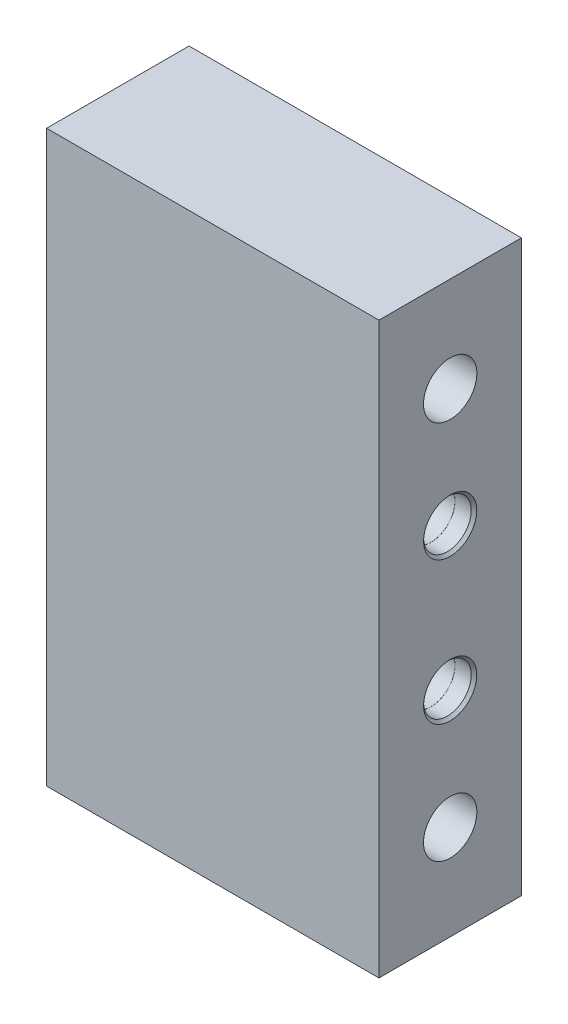
ISO-10303-21;
HEADER;
FILE_DESCRIPTION(('STEP AP214'),'2;1');
FILE_NAME('part.step','',(''),(''),'','','');
FILE_SCHEMA(('AUTOMOTIVE_DESIGN { 1 0 10303 214 1 1 1 1 }'));
ENDSEC;
DATA;
#1=APPLICATION_CONTEXT('core data for automotive mechanical design processes');
#2=APPLICATION_PROTOCOL_DEFINITION('international standard','automotive_design',2000,#1);
#3=PRODUCT_CONTEXT('',#1,'mechanical');
#4=PRODUCT('Part','Part','',(#3));
#5=PRODUCT_RELATED_PRODUCT_CATEGORY('part','',(#4));
#6=PRODUCT_DEFINITION_FORMATION('','',#4);
#7=PRODUCT_DEFINITION_CONTEXT('part definition',#1,'design');
#8=PRODUCT_DEFINITION('design','',#6,#7);
#9=PRODUCT_DEFINITION_SHAPE('','',#8);
#10=(LENGTH_UNIT() NAMED_UNIT(*) SI_UNIT(.MILLI.,.METRE.));
#11=(NAMED_UNIT(*) PLANE_ANGLE_UNIT() SI_UNIT($,.RADIAN.));
#12=(NAMED_UNIT(*) SI_UNIT($,.STERADIAN.) SOLID_ANGLE_UNIT());
#13=UNCERTAINTY_MEASURE_WITH_UNIT(LENGTH_MEASURE(1.E-05),#10,'distance_accuracy_value','');
#14=(GEOMETRIC_REPRESENTATION_CONTEXT(3) GLOBAL_UNCERTAINTY_ASSIGNED_CONTEXT((#13)) GLOBAL_UNIT_ASSIGNED_CONTEXT((#10,
#11,#12)) REPRESENTATION_CONTEXT('',''));
#15=CARTESIAN_POINT('',(0.,0.,0.));
#16=DIRECTION('',(0.,0.,1.));
#17=DIRECTION('',(1.,0.,0.));
#18=AXIS2_PLACEMENT_3D('',#15,#16,#17);
#19=CARTESIAN_POINT('',(-22.225,38.1,19.05));
#20=DIRECTION('',(1.,0.,0.));
#21=DIRECTION('',(0.,1.,0.));
#22=AXIS2_PLACEMENT_3D('',#19,#20,#21);
#23=PLANE('',#22);
#24=CARTESIAN_POINT('',(-22.225,-9.525,9.525));
#25=DIRECTION('',(-1.,0.,0.));
#26=DIRECTION('',(0.,0.,1.));
#27=AXIS2_PLACEMENT_3D('',#24,#25,#26);
#28=CIRCLE('',#27,3.556);
#29=CARTESIAN_POINT('',(-22.225,-9.525,13.081));
#30=VERTEX_POINT('',#29);
#31=EDGE_CURVE('E199',#30,#30,#28,.T.);
#32=ORIENTED_EDGE('',*,*,#31,.F.);
#33=EDGE_LOOP('',(#32));
#34=FACE_BOUND('',#33,.T.);
#35=CARTESIAN_POINT('',(-22.225,9.525,9.525));
#36=DIRECTION('',(-1.,0.,0.));
#37=DIRECTION('',(0.,0.,1.));
#38=AXIS2_PLACEMENT_3D('',#35,#36,#37);
#39=CIRCLE('',#38,3.556);
#40=CARTESIAN_POINT('',(-22.225,9.525,13.081));
#41=VERTEX_POINT('',#40);
#42=EDGE_CURVE('E203',#41,#41,#39,.T.);
#43=ORIENTED_EDGE('',*,*,#42,.F.);
#44=EDGE_LOOP('',(#43));
#45=FACE_BOUND('',#44,.T.);
#46=CARTESIAN_POINT('',(-22.225,25.4,9.525));
#47=DIRECTION('',(1.,0.,0.));
#48=DIRECTION('',(0.,0.,-1.));
#49=AXIS2_PLACEMENT_3D('',#46,#47,#48);
#50=CIRCLE('',#49,3.57123999999999);
#51=CARTESIAN_POINT('',(-22.225,25.4,5.95376000000001));
#52=VERTEX_POINT('',#51);
#53=EDGE_CURVE('E162',#52,#52,#50,.T.);
#54=ORIENTED_EDGE('',*,*,#53,.T.);
#55=EDGE_LOOP('',(#54));
#56=FACE_BOUND('',#55,.T.);
#57=CARTESIAN_POINT('',(-22.225,-25.4,9.525));
#58=DIRECTION('',(1.,0.,0.));
#59=DIRECTION('',(0.,0.,-1.));
#60=AXIS2_PLACEMENT_3D('',#57,#58,#59);
#61=CIRCLE('',#60,3.57123999999999);
#62=CARTESIAN_POINT('',(-22.225,-25.4,5.95376000000001));
#63=VERTEX_POINT('',#62);
#64=EDGE_CURVE('E103',#63,#63,#61,.T.);
#65=ORIENTED_EDGE('',*,*,#64,.T.);
#66=EDGE_LOOP('',(#65));
#67=FACE_BOUND('',#66,.T.);
#68=DIRECTION('',(0.,-1.,0.));
#69=VECTOR('',#68,1.);
#70=CARTESIAN_POINT('',(-22.225,38.1,0.));
#71=LINE('',#70,#69);
#72=CARTESIAN_POINT('',(-22.225,38.1,0.));
#73=VERTEX_POINT('',#72);
#74=CARTESIAN_POINT('',(-22.225,-38.1,0.));
#75=VERTEX_POINT('',#74);
#76=EDGE_CURVE('E100',#73,#75,#71,.T.);
#77=ORIENTED_EDGE('',*,*,#76,.T.);
#78=DIRECTION('',(0.,0.,-1.));
#79=VECTOR('',#78,1.);
#80=CARTESIAN_POINT('',(-22.225,-38.1,19.05));
#81=LINE('',#80,#79);
#82=CARTESIAN_POINT('',(-22.225,-38.1,19.05));
#83=VERTEX_POINT('',#82);
#84=EDGE_CURVE('E11',#83,#75,#81,.T.);
#85=ORIENTED_EDGE('',*,*,#84,.F.);
#86=DIRECTION('',(0.,-1.,0.));
#87=VECTOR('',#86,1.);
#88=CARTESIAN_POINT('',(-22.225,38.1,19.05));
#89=LINE('',#88,#87);
#90=CARTESIAN_POINT('',(-22.225,38.1,19.05));
#91=VERTEX_POINT('',#90);
#92=EDGE_CURVE('E87',#91,#83,#89,.T.);
#93=ORIENTED_EDGE('',*,*,#92,.F.);
#94=DIRECTION('',(0.,0.,-1.));
#95=VECTOR('',#94,1.);
#96=CARTESIAN_POINT('',(-22.225,38.1,19.05));
#97=LINE('',#96,#95);
#98=EDGE_CURVE('E96',#91,#73,#97,.T.);
#99=ORIENTED_EDGE('',*,*,#98,.T.);
#100=EDGE_LOOP('',(#77,#85,#93,#99));
#101=FACE_BOUND('',#100,.T.);
#102=ADVANCED_FACE('F34',(#34,#45,#56,#67,#101),#23,.F.);
#103=CARTESIAN_POINT('',(-22.225,-38.1,19.05));
#104=DIRECTION('',(0.,1.,0.));
#105=DIRECTION('',(0.,0.,1.));
#106=AXIS2_PLACEMENT_3D('',#103,#104,#105);
#107=PLANE('',#106);
#108=DIRECTION('',(1.,0.,0.));
#109=VECTOR('',#108,1.);
#110=CARTESIAN_POINT('',(-22.225,-38.1,0.));
#111=LINE('',#110,#109);
#112=CARTESIAN_POINT('',(22.225,-38.1,0.));
#113=VERTEX_POINT('',#112);
#114=EDGE_CURVE('E91',#75,#113,#111,.T.);
#115=ORIENTED_EDGE('',*,*,#114,.T.);
#116=DIRECTION('',(0.,0.,-1.));
#117=VECTOR('',#116,1.);
#118=CARTESIAN_POINT('',(22.225,-38.1,19.05));
#119=LINE('',#118,#117);
#120=CARTESIAN_POINT('',(22.225,-38.1,19.05));
#121=VERTEX_POINT('',#120);
#122=EDGE_CURVE('E43',#121,#113,#119,.T.);
#123=ORIENTED_EDGE('',*,*,#122,.F.);
#124=DIRECTION('',(1.,0.,0.));
#125=VECTOR('',#124,1.);
#126=CARTESIAN_POINT('',(-22.225,-38.1,19.05));
#127=LINE('',#126,#125);
#128=EDGE_CURVE('E82',#83,#121,#127,.T.);
#129=ORIENTED_EDGE('',*,*,#128,.F.);
#130=ORIENTED_EDGE('',*,*,#84,.T.);
#131=EDGE_LOOP('',(#115,#123,#129,#130));
#132=FACE_BOUND('',#131,.T.);
#133=ADVANCED_FACE('F90',(#132),#107,.F.);
#134=CARTESIAN_POINT('',(22.225,38.1,19.05));
#135=DIRECTION('',(-1.,0.,0.));
#136=DIRECTION('',(0.,-1.,0.));
#137=AXIS2_PLACEMENT_3D('',#134,#135,#136);
#138=PLANE('',#137);
#139=CARTESIAN_POINT('',(22.225,-9.525,9.525));
#140=DIRECTION('',(1.,0.,0.));
#141=DIRECTION('',(0.,0.,-1.));
#142=AXIS2_PLACEMENT_3D('',#139,#140,#141);
#143=CIRCLE('',#142,3.556);
#144=CARTESIAN_POINT('',(22.225,-9.525,5.969));
#145=VERTEX_POINT('',#144);
#146=EDGE_CURVE('E112',#145,#145,#143,.T.);
#147=ORIENTED_EDGE('',*,*,#146,.F.);
#148=EDGE_LOOP('',(#147));
#149=FACE_BOUND('',#148,.T.);
#150=CARTESIAN_POINT('',(22.225,9.525,9.525));
#151=DIRECTION('',(1.,0.,0.));
#152=DIRECTION('',(0.,0.,-1.));
#153=AXIS2_PLACEMENT_3D('',#150,#151,#152);
#154=CIRCLE('',#153,3.556);
#155=CARTESIAN_POINT('',(22.225,9.525,5.969));
#156=VERTEX_POINT('',#155);
#157=EDGE_CURVE('E144',#156,#156,#154,.T.);
#158=ORIENTED_EDGE('',*,*,#157,.F.);
#159=EDGE_LOOP('',(#158));
#160=FACE_BOUND('',#159,.T.);
#161=CARTESIAN_POINT('',(22.225,25.4,9.525));
#162=DIRECTION('',(1.,0.,0.));
#163=DIRECTION('',(0.,0.,-1.));
#164=AXIS2_PLACEMENT_3D('',#161,#162,#163);
#165=CIRCLE('',#164,3.57124);
#166=CARTESIAN_POINT('',(22.225,25.4,5.95376));
#167=VERTEX_POINT('',#166);
#168=EDGE_CURVE('E159',#167,#167,#165,.T.);
#169=ORIENTED_EDGE('',*,*,#168,.F.);
#170=EDGE_LOOP('',(#169));
#171=FACE_BOUND('',#170,.T.);
#172=CARTESIAN_POINT('',(22.225,-25.4,9.525));
#173=DIRECTION('',(1.,0.,0.));
#174=DIRECTION('',(0.,0.,-1.));
#175=AXIS2_PLACEMENT_3D('',#172,#173,#174);
#176=CIRCLE('',#175,3.57124);
#177=CARTESIAN_POINT('',(22.225,-25.4,5.95376));
#178=VERTEX_POINT('',#177);
#179=EDGE_CURVE('E165',#178,#178,#176,.T.);
#180=ORIENTED_EDGE('',*,*,#179,.F.);
#181=EDGE_LOOP('',(#180));
#182=FACE_BOUND('',#181,.T.);
#183=DIRECTION('',(0.,1.,0.));
#184=VECTOR('',#183,1.);
#185=CARTESIAN_POINT('',(22.225,38.1,0.));
#186=LINE('',#185,#184);
#187=CARTESIAN_POINT('',(22.225,38.1,0.));
#188=VERTEX_POINT('',#187);
#189=EDGE_CURVE('E69',#113,#188,#186,.T.);
#190=ORIENTED_EDGE('',*,*,#189,.T.);
#191=DIRECTION('',(0.,0.,-1.));
#192=VECTOR('',#191,1.);
#193=CARTESIAN_POINT('',(22.225,38.1,19.05));
#194=LINE('',#193,#192);
#195=CARTESIAN_POINT('',(22.225,38.1,19.05));
#196=VERTEX_POINT('',#195);
#197=EDGE_CURVE('E92',#196,#188,#194,.T.);
#198=ORIENTED_EDGE('',*,*,#197,.F.);
#199=DIRECTION('',(0.,1.,0.));
#200=VECTOR('',#199,1.);
#201=CARTESIAN_POINT('',(22.225,38.1,19.05));
#202=LINE('',#201,#200);
#203=EDGE_CURVE('E85',#121,#196,#202,.T.);
#204=ORIENTED_EDGE('',*,*,#203,.F.);
#205=ORIENTED_EDGE('',*,*,#122,.T.);
#206=EDGE_LOOP('',(#190,#198,#204,#205));
#207=FACE_BOUND('',#206,.T.);
#208=ADVANCED_FACE('F94',(#149,#160,#171,#182,#207),#138,.F.);
#209=CARTESIAN_POINT('',(-22.225,38.1,19.05));
#210=DIRECTION('',(0.,-1.,0.));
#211=DIRECTION('',(0.,0.,-1.));
#212=AXIS2_PLACEMENT_3D('',#209,#210,#211);
#213=PLANE('',#212);
#214=DIRECTION('',(-1.,0.,0.));
#215=VECTOR('',#214,1.);
#216=CARTESIAN_POINT('',(-22.225,38.1,0.));
#217=LINE('',#216,#215);
#218=EDGE_CURVE('E75',#188,#73,#217,.T.);
#219=ORIENTED_EDGE('',*,*,#218,.T.);
#220=ORIENTED_EDGE('',*,*,#98,.F.);
#221=DIRECTION('',(-1.,0.,0.));
#222=VECTOR('',#221,1.);
#223=CARTESIAN_POINT('',(-22.225,38.1,19.05));
#224=LINE('',#223,#222);
#225=EDGE_CURVE('E52',#196,#91,#224,.T.);
#226=ORIENTED_EDGE('',*,*,#225,.F.);
#227=ORIENTED_EDGE('',*,*,#197,.T.);
#228=EDGE_LOOP('',(#219,#220,#226,#227));
#229=FACE_BOUND('',#228,.T.);
#230=ADVANCED_FACE('F182',(#229),#213,.F.);
#231=CARTESIAN_POINT('',(-22.225,-38.1,19.05));
#232=DIRECTION('',(0.,0.,1.));
#233=DIRECTION('',(1.,0.,0.));
#234=AXIS2_PLACEMENT_3D('',#231,#232,#233);
#235=PLANE('',#234);
#236=ORIENTED_EDGE('',*,*,#92,.T.);
#237=ORIENTED_EDGE('',*,*,#128,.T.);
#238=ORIENTED_EDGE('',*,*,#203,.T.);
#239=ORIENTED_EDGE('',*,*,#225,.T.);
#240=EDGE_LOOP('',(#236,#237,#238,#239));
#241=FACE_BOUND('',#240,.T.);
#242=ADVANCED_FACE('F83',(#241),#235,.T.);
#243=CARTESIAN_POINT('',(-22.225,-38.1,0.));
#244=DIRECTION('',(0.,0.,1.));
#245=DIRECTION('',(1.,0.,0.));
#246=AXIS2_PLACEMENT_3D('',#243,#244,#245);
#247=PLANE('',#246);
#248=ORIENTED_EDGE('',*,*,#76,.F.);
#249=ORIENTED_EDGE('',*,*,#218,.F.);
#250=ORIENTED_EDGE('',*,*,#189,.F.);
#251=ORIENTED_EDGE('',*,*,#114,.F.);
#252=EDGE_LOOP('',(#248,#249,#250,#251));
#253=FACE_BOUND('',#252,.T.);
#254=ADVANCED_FACE('F177',(#253),#247,.F.);
#255=CARTESIAN_POINT('',(22.225,-25.4,9.525));
#256=DIRECTION('',(1.,0.,0.));
#257=DIRECTION('',(0.,0.,-1.));
#258=AXIS2_PLACEMENT_3D('',#255,#256,#257);
#259=CYLINDRICAL_SURFACE('',#258,3.57123999999999);
#260=ORIENTED_EDGE('',*,*,#64,.F.);
#261=EDGE_LOOP('',(#260));
#262=FACE_BOUND('',#261,.T.);
#263=ORIENTED_EDGE('',*,*,#179,.T.);
#264=EDGE_LOOP('',(#263));
#265=FACE_BOUND('',#264,.T.);
#266=ADVANCED_FACE('F173',(#262,#265),#259,.F.);
#267=CARTESIAN_POINT('',(22.225,25.4,9.525));
#268=DIRECTION('',(1.,0.,0.));
#269=DIRECTION('',(0.,0.,-1.));
#270=AXIS2_PLACEMENT_3D('',#267,#268,#269);
#271=CYLINDRICAL_SURFACE('',#270,3.57123999999999);
#272=ORIENTED_EDGE('',*,*,#53,.F.);
#273=EDGE_LOOP('',(#272));
#274=FACE_BOUND('',#273,.T.);
#275=ORIENTED_EDGE('',*,*,#168,.T.);
#276=EDGE_LOOP('',(#275));
#277=FACE_BOUND('',#276,.T.);
#278=ADVANCED_FACE('F176',(#274,#277),#271,.F.);
#279=CARTESIAN_POINT('',(12.573,9.525,9.525));
#280=DIRECTION('',(1.,0.,0.));
#281=DIRECTION('',(0.,0.,-1.));
#282=AXIS2_PLACEMENT_3D('',#279,#280,#281);
#283=CONICAL_SURFACE('',#282,3.175,1.02974425867665);
#284=CARTESIAN_POINT('',(12.0960668836469,9.525,9.525));
#285=DIRECTION('',(1.,0.,0.));
#286=DIRECTION('',(0.,0.,-1.));
#287=AXIS2_PLACEMENT_3D('',#284,#285,#286);
#288=CIRCLE('',#287,2.38124999999999);
#289=CARTESIAN_POINT('',(12.0960668836469,9.525,7.14375000000001));
#290=VERTEX_POINT('',#289);
#291=EDGE_CURVE('E113',#290,#290,#288,.F.);
#292=ORIENTED_EDGE('',*,*,#291,.T.);
#293=EDGE_LOOP('',(#292));
#294=FACE_BOUND('',#293,.T.);
#295=CARTESIAN_POINT('',(12.573,9.525,9.525));
#296=DIRECTION('',(1.,0.,0.));
#297=DIRECTION('',(0.,0.,-1.));
#298=AXIS2_PLACEMENT_3D('',#295,#296,#297);
#299=CIRCLE('',#298,3.175);
#300=CARTESIAN_POINT('',(12.573,9.525,6.35));
#301=VERTEX_POINT('',#300);
#302=EDGE_CURVE('E156',#301,#301,#299,.T.);
#303=ORIENTED_EDGE('',*,*,#302,.T.);
#304=EDGE_LOOP('',(#303));
#305=FACE_BOUND('',#304,.T.);
#306=ADVANCED_FACE('F208',(#294,#305),#283,.F.);
#307=CARTESIAN_POINT('',(22.225,9.525,9.525));
#308=DIRECTION('',(1.,0.,0.));
#309=DIRECTION('',(0.,0.,-1.));
#310=AXIS2_PLACEMENT_3D('',#307,#308,#309);
#311=CYLINDRICAL_SURFACE('',#310,3.175);
#312=ORIENTED_EDGE('',*,*,#302,.F.);
#313=EDGE_LOOP('',(#312));
#314=FACE_BOUND('',#313,.T.);
#315=CARTESIAN_POINT('',(19.685,9.525,9.525));
#316=DIRECTION('',(1.,0.,0.));
#317=DIRECTION('',(0.,0.,-1.));
#318=AXIS2_PLACEMENT_3D('',#315,#316,#317);
#319=CIRCLE('',#318,3.175);
#320=CARTESIAN_POINT('',(19.685,9.525,6.35));
#321=VERTEX_POINT('',#320);
#322=EDGE_CURVE('E153',#321,#321,#319,.T.);
#323=ORIENTED_EDGE('',*,*,#322,.T.);
#324=EDGE_LOOP('',(#323));
#325=FACE_BOUND('',#324,.T.);
#326=ADVANCED_FACE('F215',(#314,#325),#311,.F.);
#327=CARTESIAN_POINT('',(19.685,12.7,9.525));
#328=DIRECTION('',(-1.,0.,0.));
#329=DIRECTION('',(0.,0.,1.));
#330=AXIS2_PLACEMENT_3D('',#327,#328,#329);
#331=PLANE('',#330);
#332=ORIENTED_EDGE('',*,*,#322,.F.);
#333=EDGE_LOOP('',(#332));
#334=FACE_BOUND('',#333,.T.);
#335=CARTESIAN_POINT('',(19.685,9.525,9.525));
#336=DIRECTION('',(1.,0.,0.));
#337=DIRECTION('',(0.,0.,-1.));
#338=AXIS2_PLACEMENT_3D('',#335,#336,#337);
#339=CIRCLE('',#338,3.1877);
#340=CARTESIAN_POINT('',(19.685,9.525,6.3373));
#341=VERTEX_POINT('',#340);
#342=EDGE_CURVE('E150',#341,#341,#339,.T.);
#343=ORIENTED_EDGE('',*,*,#342,.T.);
#344=EDGE_LOOP('',(#343));
#345=FACE_BOUND('',#344,.T.);
#346=ADVANCED_FACE('F255',(#334,#345),#331,.F.);
#347=CARTESIAN_POINT('',(22.225,9.525,9.525));
#348=DIRECTION('',(1.,0.,0.));
#349=DIRECTION('',(0.,0.,-1.));
#350=AXIS2_PLACEMENT_3D('',#347,#348,#349);
#351=CYLINDRICAL_SURFACE('',#350,3.1877);
#352=ORIENTED_EDGE('',*,*,#342,.F.);
#353=EDGE_LOOP('',(#352));
#354=FACE_BOUND('',#353,.T.);
#355=CARTESIAN_POINT('',(21.8567,9.525,9.525));
#356=DIRECTION('',(1.,0.,0.));
#357=DIRECTION('',(0.,0.,-1.));
#358=AXIS2_PLACEMENT_3D('',#355,#356,#357);
#359=CIRCLE('',#358,3.1877);
#360=CARTESIAN_POINT('',(21.8567,9.525,6.3373));
#361=VERTEX_POINT('',#360);
#362=EDGE_CURVE('E147',#361,#361,#359,.T.);
#363=ORIENTED_EDGE('',*,*,#362,.T.);
#364=EDGE_LOOP('',(#363));
#365=FACE_BOUND('',#364,.T.);
#366=ADVANCED_FACE('F264',(#354,#365),#351,.F.);
#367=CARTESIAN_POINT('',(22.225,9.525,9.525));
#368=DIRECTION('',(1.,0.,0.));
#369=DIRECTION('',(0.,0.,-1.));
#370=AXIS2_PLACEMENT_3D('',#367,#368,#369);
#371=CONICAL_SURFACE('',#370,3.556,0.785398163397446);
#372=ORIENTED_EDGE('',*,*,#362,.F.);
#373=EDGE_LOOP('',(#372));
#374=FACE_BOUND('',#373,.T.);
#375=ORIENTED_EDGE('',*,*,#157,.T.);
#376=EDGE_LOOP('',(#375));
#377=FACE_BOUND('',#376,.T.);
#378=ADVANCED_FACE('F274',(#374,#377),#371,.F.);
#379=CARTESIAN_POINT('',(12.573,-9.525,9.525));
#380=DIRECTION('',(1.,0.,0.));
#381=DIRECTION('',(0.,0.,-1.));
#382=AXIS2_PLACEMENT_3D('',#379,#380,#381);
#383=CONICAL_SURFACE('',#382,3.175,1.02974425867665);
#384=CARTESIAN_POINT('',(12.0960668836469,-9.525,9.525));
#385=DIRECTION('',(1.,0.,0.));
#386=DIRECTION('',(0.,0.,-1.));
#387=AXIS2_PLACEMENT_3D('',#384,#385,#386);
#388=CIRCLE('',#387,2.38124999999999);
#389=CARTESIAN_POINT('',(12.0960668836469,-9.525,7.14375000000001));
#390=VERTEX_POINT('',#389);
#391=EDGE_CURVE('E109',#390,#390,#388,.F.);
#392=ORIENTED_EDGE('',*,*,#391,.T.);
#393=EDGE_LOOP('',(#392));
#394=FACE_BOUND('',#393,.T.);
#395=CARTESIAN_POINT('',(12.573,-9.525,9.525));
#396=DIRECTION('',(1.,0.,0.));
#397=DIRECTION('',(0.,0.,-1.));
#398=AXIS2_PLACEMENT_3D('',#395,#396,#397);
#399=CIRCLE('',#398,3.175);
#400=CARTESIAN_POINT('',(12.573,-9.525,6.35));
#401=VERTEX_POINT('',#400);
#402=EDGE_CURVE('E141',#401,#401,#399,.T.);
#403=ORIENTED_EDGE('',*,*,#402,.T.);
#404=EDGE_LOOP('',(#403));
#405=FACE_BOUND('',#404,.T.);
#406=ADVANCED_FACE('F284',(#394,#405),#383,.F.);
#407=CARTESIAN_POINT('',(22.225,-9.525,9.525));
#408=DIRECTION('',(1.,0.,0.));
#409=DIRECTION('',(0.,0.,-1.));
#410=AXIS2_PLACEMENT_3D('',#407,#408,#409);
#411=CYLINDRICAL_SURFACE('',#410,3.175);
#412=ORIENTED_EDGE('',*,*,#402,.F.);
#413=EDGE_LOOP('',(#412));
#414=FACE_BOUND('',#413,.T.);
#415=CARTESIAN_POINT('',(19.685,-9.525,9.525));
#416=DIRECTION('',(1.,0.,0.));
#417=DIRECTION('',(0.,0.,-1.));
#418=AXIS2_PLACEMENT_3D('',#415,#416,#417);
#419=CIRCLE('',#418,3.175);
#420=CARTESIAN_POINT('',(19.685,-9.525,6.35));
#421=VERTEX_POINT('',#420);
#422=EDGE_CURVE('E138',#421,#421,#419,.T.);
#423=ORIENTED_EDGE('',*,*,#422,.T.);
#424=EDGE_LOOP('',(#423));
#425=FACE_BOUND('',#424,.T.);
#426=ADVANCED_FACE('F292',(#414,#425),#411,.F.);
#427=CARTESIAN_POINT('',(19.685,-6.35,9.525));
#428=DIRECTION('',(-1.,0.,0.));
#429=DIRECTION('',(0.,0.,1.));
#430=AXIS2_PLACEMENT_3D('',#427,#428,#429);
#431=PLANE('',#430);
#432=ORIENTED_EDGE('',*,*,#422,.F.);
#433=EDGE_LOOP('',(#432));
#434=FACE_BOUND('',#433,.T.);
#435=CARTESIAN_POINT('',(19.685,-9.525,9.525));
#436=DIRECTION('',(1.,0.,0.));
#437=DIRECTION('',(0.,0.,-1.));
#438=AXIS2_PLACEMENT_3D('',#435,#436,#437);
#439=CIRCLE('',#438,3.1877);
#440=CARTESIAN_POINT('',(19.685,-9.525,6.3373));
#441=VERTEX_POINT('',#440);
#442=EDGE_CURVE('E135',#441,#441,#439,.T.);
#443=ORIENTED_EDGE('',*,*,#442,.T.);
#444=EDGE_LOOP('',(#443));
#445=FACE_BOUND('',#444,.T.);
#446=ADVANCED_FACE('F297',(#434,#445),#431,.F.);
#447=CARTESIAN_POINT('',(22.225,-9.525,9.525));
#448=DIRECTION('',(1.,0.,0.));
#449=DIRECTION('',(0.,0.,-1.));
#450=AXIS2_PLACEMENT_3D('',#447,#448,#449);
#451=CYLINDRICAL_SURFACE('',#450,3.1877);
#452=ORIENTED_EDGE('',*,*,#442,.F.);
#453=EDGE_LOOP('',(#452));
#454=FACE_BOUND('',#453,.T.);
#455=CARTESIAN_POINT('',(21.8567,-9.525,9.525));
#456=DIRECTION('',(1.,0.,0.));
#457=DIRECTION('',(0.,0.,-1.));
#458=AXIS2_PLACEMENT_3D('',#455,#456,#457);
#459=CIRCLE('',#458,3.1877);
#460=CARTESIAN_POINT('',(21.8567,-9.525,6.3373));
#461=VERTEX_POINT('',#460);
#462=EDGE_CURVE('E132',#461,#461,#459,.T.);
#463=ORIENTED_EDGE('',*,*,#462,.T.);
#464=EDGE_LOOP('',(#463));
#465=FACE_BOUND('',#464,.T.);
#466=ADVANCED_FACE('F307',(#454,#465),#451,.F.);
#467=CARTESIAN_POINT('',(22.225,-9.525,9.525));
#468=DIRECTION('',(1.,0.,0.));
#469=DIRECTION('',(0.,0.,-1.));
#470=AXIS2_PLACEMENT_3D('',#467,#468,#469);
#471=CONICAL_SURFACE('',#470,3.556,0.785398163397447);
#472=ORIENTED_EDGE('',*,*,#462,.F.);
#473=EDGE_LOOP('',(#472));
#474=FACE_BOUND('',#473,.T.);
#475=ORIENTED_EDGE('',*,*,#146,.T.);
#476=EDGE_LOOP('',(#475));
#477=FACE_BOUND('',#476,.T.);
#478=ADVANCED_FACE('F317',(#474,#477),#471,.F.);
#479=CARTESIAN_POINT('',(22.225,-9.525,9.525));
#480=DIRECTION('',(1.,0.,0.));
#481=DIRECTION('',(0.,0.,-1.));
#482=AXIS2_PLACEMENT_3D('',#479,#480,#481);
#483=CYLINDRICAL_SURFACE('',#482,2.38124999999999);
#484=CARTESIAN_POINT('',(-12.0960668836469,-9.525,9.525));
#485=DIRECTION('',(-1.,0.,0.));
#486=DIRECTION('',(0.,0.,1.));
#487=AXIS2_PLACEMENT_3D('',#484,#485,#486);
#488=CIRCLE('',#487,2.38124999999999);
#489=CARTESIAN_POINT('',(-12.0960668836469,-9.525,11.90625));
#490=VERTEX_POINT('',#489);
#491=EDGE_CURVE('E37',#490,#490,#488,.T.);
#492=ORIENTED_EDGE('',*,*,#491,.T.);
#493=EDGE_LOOP('',(#492));
#494=FACE_BOUND('',#493,.T.);
#495=ORIENTED_EDGE('',*,*,#391,.F.);
#496=EDGE_LOOP('',(#495));
#497=FACE_BOUND('',#496,.T.);
#498=ADVANCED_FACE('F327',(#494,#497),#483,.F.);
#499=CARTESIAN_POINT('',(22.225,9.525,9.525));
#500=DIRECTION('',(1.,0.,0.));
#501=DIRECTION('',(0.,0.,-1.));
#502=AXIS2_PLACEMENT_3D('',#499,#500,#501);
#503=CYLINDRICAL_SURFACE('',#502,2.38124999999999);
#504=CARTESIAN_POINT('',(-12.0960668836469,9.525,9.525));
#505=DIRECTION('',(-1.,0.,0.));
#506=DIRECTION('',(0.,0.,1.));
#507=AXIS2_PLACEMENT_3D('',#504,#505,#506);
#508=CIRCLE('',#507,2.38124999999999);
#509=CARTESIAN_POINT('',(-12.0960668836469,9.525,11.90625));
#510=VERTEX_POINT('',#509);
#511=EDGE_CURVE('E115',#510,#510,#508,.T.);
#512=ORIENTED_EDGE('',*,*,#511,.T.);
#513=EDGE_LOOP('',(#512));
#514=FACE_BOUND('',#513,.T.);
#515=ORIENTED_EDGE('',*,*,#291,.F.);
#516=EDGE_LOOP('',(#515));
#517=FACE_BOUND('',#516,.T.);
#518=ADVANCED_FACE('F353',(#514,#517),#503,.F.);
#519=CARTESIAN_POINT('',(-12.573,9.525,9.525));
#520=DIRECTION('',(-1.,0.,0.));
#521=DIRECTION('',(0.,0.,1.));
#522=AXIS2_PLACEMENT_3D('',#519,#520,#521);
#523=CONICAL_SURFACE('',#522,3.175,1.02974425867665);
#524=CARTESIAN_POINT('',(-12.573,9.525,9.525));
#525=DIRECTION('',(-1.,0.,0.));
#526=DIRECTION('',(0.,0.,1.));
#527=AXIS2_PLACEMENT_3D('',#524,#525,#526);
#528=CIRCLE('',#527,3.175);
#529=CARTESIAN_POINT('',(-12.573,9.525,12.7));
#530=VERTEX_POINT('',#529);
#531=EDGE_CURVE('E117',#530,#530,#528,.T.);
#532=ORIENTED_EDGE('',*,*,#531,.T.);
#533=EDGE_LOOP('',(#532));
#534=FACE_BOUND('',#533,.T.);
#535=ORIENTED_EDGE('',*,*,#511,.F.);
#536=EDGE_LOOP('',(#535));
#537=FACE_BOUND('',#536,.T.);
#538=ADVANCED_FACE('F363',(#534,#537),#523,.F.);
#539=CARTESIAN_POINT('',(-22.225,9.525,9.525));
#540=DIRECTION('',(-1.,0.,0.));
#541=DIRECTION('',(0.,0.,1.));
#542=AXIS2_PLACEMENT_3D('',#539,#540,#541);
#543=CYLINDRICAL_SURFACE('',#542,3.175);
#544=ORIENTED_EDGE('',*,*,#531,.F.);
#545=EDGE_LOOP('',(#544));
#546=FACE_BOUND('',#545,.T.);
#547=CARTESIAN_POINT('',(-19.685,9.525,9.525));
#548=DIRECTION('',(-1.,0.,0.));
#549=DIRECTION('',(0.,0.,1.));
#550=AXIS2_PLACEMENT_3D('',#547,#548,#549);
#551=CIRCLE('',#550,3.175);
#552=CARTESIAN_POINT('',(-19.685,9.525,12.7));
#553=VERTEX_POINT('',#552);
#554=EDGE_CURVE('E121',#553,#553,#551,.T.);
#555=ORIENTED_EDGE('',*,*,#554,.T.);
#556=EDGE_LOOP('',(#555));
#557=FACE_BOUND('',#556,.T.);
#558=ADVANCED_FACE('F372',(#546,#557),#543,.F.);
#559=CARTESIAN_POINT('',(-19.685,12.7,9.525));
#560=DIRECTION('',(1.,0.,0.));
#561=DIRECTION('',(0.,0.,-1.));
#562=AXIS2_PLACEMENT_3D('',#559,#560,#561);
#563=PLANE('',#562);
#564=ORIENTED_EDGE('',*,*,#554,.F.);
#565=EDGE_LOOP('',(#564));
#566=FACE_BOUND('',#565,.T.);
#567=CARTESIAN_POINT('',(-19.685,9.525,9.525));
#568=DIRECTION('',(-1.,0.,0.));
#569=DIRECTION('',(0.,0.,1.));
#570=AXIS2_PLACEMENT_3D('',#567,#568,#569);
#571=CIRCLE('',#570,3.1877);
#572=CARTESIAN_POINT('',(-19.685,9.525,12.7127));
#573=VERTEX_POINT('',#572);
#574=EDGE_CURVE('E126',#573,#573,#571,.T.);
#575=ORIENTED_EDGE('',*,*,#574,.T.);
#576=EDGE_LOOP('',(#575));
#577=FACE_BOUND('',#576,.T.);
#578=ADVANCED_FACE('F381',(#566,#577),#563,.F.);
#579=CARTESIAN_POINT('',(-22.225,9.525,9.525));
#580=DIRECTION('',(-1.,0.,0.));
#581=DIRECTION('',(0.,0.,1.));
#582=AXIS2_PLACEMENT_3D('',#579,#580,#581);
#583=CYLINDRICAL_SURFACE('',#582,3.1877);
#584=ORIENTED_EDGE('',*,*,#574,.F.);
#585=EDGE_LOOP('',(#584));
#586=FACE_BOUND('',#585,.T.);
#587=CARTESIAN_POINT('',(-21.8567,9.525,9.525));
#588=DIRECTION('',(-1.,0.,0.));
#589=DIRECTION('',(0.,0.,1.));
#590=AXIS2_PLACEMENT_3D('',#587,#588,#589);
#591=CIRCLE('',#590,3.1877);
#592=CARTESIAN_POINT('',(-21.8567,9.525,12.7127));
#593=VERTEX_POINT('',#592);
#594=EDGE_CURVE('E482',#593,#593,#591,.T.);
#595=ORIENTED_EDGE('',*,*,#594,.T.);
#596=EDGE_LOOP('',(#595));
#597=FACE_BOUND('',#596,.T.);
#598=ADVANCED_FACE('F391',(#586,#597),#583,.F.);
#599=CARTESIAN_POINT('',(-22.225,9.525,9.525));
#600=DIRECTION('',(-1.,0.,0.));
#601=DIRECTION('',(0.,0.,1.));
#602=AXIS2_PLACEMENT_3D('',#599,#600,#601);
#603=CONICAL_SURFACE('',#602,3.556,0.785398163397446);
#604=ORIENTED_EDGE('',*,*,#594,.F.);
#605=EDGE_LOOP('',(#604));
#606=FACE_BOUND('',#605,.T.);
#607=ORIENTED_EDGE('',*,*,#42,.T.);
#608=EDGE_LOOP('',(#607));
#609=FACE_BOUND('',#608,.T.);
#610=ADVANCED_FACE('F401',(#606,#609),#603,.F.);
#611=CARTESIAN_POINT('',(-12.573,-9.525,9.525));
#612=DIRECTION('',(-1.,0.,0.));
#613=DIRECTION('',(0.,0.,1.));
#614=AXIS2_PLACEMENT_3D('',#611,#612,#613);
#615=CONICAL_SURFACE('',#614,3.175,1.02974425867665);
#616=CARTESIAN_POINT('',(-12.573,-9.525,9.525));
#617=DIRECTION('',(-1.,0.,0.));
#618=DIRECTION('',(0.,0.,1.));
#619=AXIS2_PLACEMENT_3D('',#616,#617,#618);
#620=CIRCLE('',#619,3.175);
#621=CARTESIAN_POINT('',(-12.573,-9.525,12.7));
#622=VERTEX_POINT('',#621);
#623=EDGE_CURVE('E478',#622,#622,#620,.T.);
#624=ORIENTED_EDGE('',*,*,#623,.T.);
#625=EDGE_LOOP('',(#624));
#626=FACE_BOUND('',#625,.T.);
#627=ORIENTED_EDGE('',*,*,#491,.F.);
#628=EDGE_LOOP('',(#627));
#629=FACE_BOUND('',#628,.T.);
#630=ADVANCED_FACE('F411',(#626,#629),#615,.F.);
#631=CARTESIAN_POINT('',(-22.225,-9.525,9.525));
#632=DIRECTION('',(-1.,0.,0.));
#633=DIRECTION('',(0.,0.,1.));
#634=AXIS2_PLACEMENT_3D('',#631,#632,#633);
#635=CYLINDRICAL_SURFACE('',#634,3.175);
#636=ORIENTED_EDGE('',*,*,#623,.F.);
#637=EDGE_LOOP('',(#636));
#638=FACE_BOUND('',#637,.T.);
#639=CARTESIAN_POINT('',(-19.685,-9.525,9.525));
#640=DIRECTION('',(-1.,0.,0.));
#641=DIRECTION('',(0.,0.,1.));
#642=AXIS2_PLACEMENT_3D('',#639,#640,#641);
#643=CIRCLE('',#642,3.175);
#644=CARTESIAN_POINT('',(-19.685,-9.525,12.7));
#645=VERTEX_POINT('',#644);
#646=EDGE_CURVE('E475',#645,#645,#643,.T.);
#647=ORIENTED_EDGE('',*,*,#646,.T.);
#648=EDGE_LOOP('',(#647));
#649=FACE_BOUND('',#648,.T.);
#650=ADVANCED_FACE('F421',(#638,#649),#635,.F.);
#651=CARTESIAN_POINT('',(-19.685,-6.35,9.525));
#652=DIRECTION('',(1.,0.,0.));
#653=DIRECTION('',(0.,0.,-1.));
#654=AXIS2_PLACEMENT_3D('',#651,#652,#653);
#655=PLANE('',#654);
#656=ORIENTED_EDGE('',*,*,#646,.F.);
#657=EDGE_LOOP('',(#656));
#658=FACE_BOUND('',#657,.T.);
#659=CARTESIAN_POINT('',(-19.685,-9.525,9.525));
#660=DIRECTION('',(-1.,0.,0.));
#661=DIRECTION('',(0.,0.,1.));
#662=AXIS2_PLACEMENT_3D('',#659,#660,#661);
#663=CIRCLE('',#662,3.1877);
#664=CARTESIAN_POINT('',(-19.685,-9.525,12.7127));
#665=VERTEX_POINT('',#664);
#666=EDGE_CURVE('E470',#665,#665,#663,.T.);
#667=ORIENTED_EDGE('',*,*,#666,.T.);
#668=EDGE_LOOP('',(#667));
#669=FACE_BOUND('',#668,.T.);
#670=ADVANCED_FACE('F431',(#658,#669),#655,.F.);
#671=CARTESIAN_POINT('',(-22.225,-9.525,9.525));
#672=DIRECTION('',(-1.,0.,0.));
#673=DIRECTION('',(0.,0.,1.));
#674=AXIS2_PLACEMENT_3D('',#671,#672,#673);
#675=CYLINDRICAL_SURFACE('',#674,3.1877);
#676=ORIENTED_EDGE('',*,*,#666,.F.);
#677=EDGE_LOOP('',(#676));
#678=FACE_BOUND('',#677,.T.);
#679=CARTESIAN_POINT('',(-21.8567,-9.525,9.525));
#680=DIRECTION('',(-1.,0.,0.));
#681=DIRECTION('',(0.,0.,1.));
#682=AXIS2_PLACEMENT_3D('',#679,#680,#681);
#683=CIRCLE('',#682,3.1877);
#684=CARTESIAN_POINT('',(-21.8567,-9.525,12.7127));
#685=VERTEX_POINT('',#684);
#686=EDGE_CURVE('E468',#685,#685,#683,.T.);
#687=ORIENTED_EDGE('',*,*,#686,.T.);
#688=EDGE_LOOP('',(#687));
#689=FACE_BOUND('',#688,.T.);
#690=ADVANCED_FACE('F441',(#678,#689),#675,.F.);
#691=CARTESIAN_POINT('',(-22.225,-9.525,9.525));
#692=DIRECTION('',(-1.,0.,0.));
#693=DIRECTION('',(0.,0.,1.));
#694=AXIS2_PLACEMENT_3D('',#691,#692,#693);
#695=CONICAL_SURFACE('',#694,3.556,0.785398163397447);
#696=ORIENTED_EDGE('',*,*,#686,.F.);
#697=EDGE_LOOP('',(#696));
#698=FACE_BOUND('',#697,.T.);
#699=ORIENTED_EDGE('',*,*,#31,.T.);
#700=EDGE_LOOP('',(#699));
#701=FACE_BOUND('',#700,.T.);
#702=ADVANCED_FACE('F451',(#698,#701),#695,.F.);
#703=CLOSED_SHELL('',(#102,#133,#208,#230,#242,#254,#266,#278,#306,#326,#346,#366,#378,#406,
#426,#446,#466,#478,#498,#518,#538,#558,#578,#598,#610,#630,#650,#670,#690,#702));
#704=MANIFOLD_SOLID_BREP('B2',#703);
#705=ADVANCED_BREP_SHAPE_REPRESENTATION('',(#18,#704),#14);
#706=SHAPE_DEFINITION_REPRESENTATION(#9,#705);
ENDSEC;
END-ISO-10303-21;
